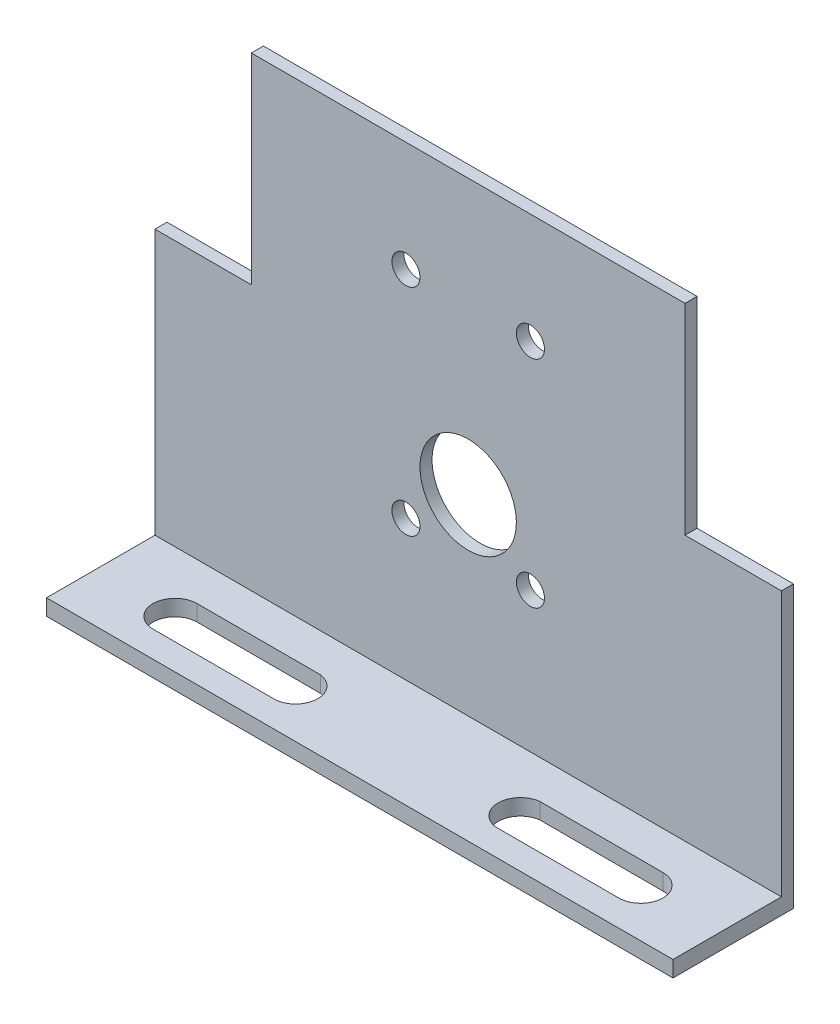
ISO-10303-21;
HEADER;
FILE_DESCRIPTION(('STEP AP214'),'2;1');
FILE_NAME('part.step','',(''),(''),'','','');
FILE_SCHEMA(('AUTOMOTIVE_DESIGN { 1 0 10303 214 1 1 1 1 }'));
ENDSEC;
DATA;
#1=APPLICATION_CONTEXT('core data for automotive mechanical design processes');
#2=APPLICATION_PROTOCOL_DEFINITION('international standard','automotive_design',2000,#1);
#3=PRODUCT_CONTEXT('',#1,'mechanical');
#4=PRODUCT('Part','Part','',(#3));
#5=PRODUCT_RELATED_PRODUCT_CATEGORY('part','',(#4));
#6=PRODUCT_DEFINITION_FORMATION('','',#4);
#7=PRODUCT_DEFINITION_CONTEXT('part definition',#1,'design');
#8=PRODUCT_DEFINITION('design','',#6,#7);
#9=PRODUCT_DEFINITION_SHAPE('','',#8);
#10=(LENGTH_UNIT() NAMED_UNIT(*) SI_UNIT(.MILLI.,.METRE.));
#11=(NAMED_UNIT(*) PLANE_ANGLE_UNIT() SI_UNIT($,.RADIAN.));
#12=(NAMED_UNIT(*) SI_UNIT($,.STERADIAN.) SOLID_ANGLE_UNIT());
#13=UNCERTAINTY_MEASURE_WITH_UNIT(LENGTH_MEASURE(1.E-05),#10,'distance_accuracy_value','');
#14=(GEOMETRIC_REPRESENTATION_CONTEXT(3) GLOBAL_UNCERTAINTY_ASSIGNED_CONTEXT((#13)) GLOBAL_UNIT_ASSIGNED_CONTEXT((#10,
#11,#12)) REPRESENTATION_CONTEXT('',''));
#15=CARTESIAN_POINT('',(0.,0.,0.));
#16=DIRECTION('',(0.,0.,1.));
#17=DIRECTION('',(1.,0.,0.));
#18=AXIS2_PLACEMENT_3D('',#15,#16,#17);
#19=CARTESIAN_POINT('',(0.,0.,1.5));
#20=DIRECTION('',(0.,0.,-1.));
#21=DIRECTION('',(-1.,0.,0.));
#22=AXIS2_PLACEMENT_3D('',#19,#20,#21);
#23=PLANE('',#22);
#24=DIRECTION('',(0.,-1.,0.));
#25=VECTOR('',#24,1.);
#26=CARTESIAN_POINT('',(-77.9999999999994,0.,1.5));
#27=LINE('',#26,#25);
#28=CARTESIAN_POINT('',(-77.9999999999994,34.9999999999999,1.5));
#29=VERTEX_POINT('',#28);
#30=CARTESIAN_POINT('',(-77.9999999999994,2.,1.5));
#31=VERTEX_POINT('',#30);
#32=EDGE_CURVE('E257',#29,#31,#27,.T.);
#33=ORIENTED_EDGE('',*,*,#32,.T.);
#34=DIRECTION('',(1.,0.,0.));
#35=VECTOR('',#34,1.);
#36=CARTESIAN_POINT('',(0.,1.99999999999999,1.5));
#37=LINE('',#36,#35);
#38=CARTESIAN_POINT('',(0.,1.99999999999999,1.5));
#39=VERTEX_POINT('',#38);
#40=EDGE_CURVE('E221',#31,#39,#37,.T.);
#41=ORIENTED_EDGE('',*,*,#40,.T.);
#42=DIRECTION('',(0.,1.,0.));
#43=VECTOR('',#42,1.);
#44=CARTESIAN_POINT('',(0.,0.,1.5));
#45=LINE('',#44,#43);
#46=CARTESIAN_POINT('',(0.,34.9999999999999,1.5));
#47=VERTEX_POINT('',#46);
#48=EDGE_CURVE('E260',#39,#47,#45,.T.);
#49=ORIENTED_EDGE('',*,*,#48,.T.);
#50=DIRECTION('',(-1.,0.,0.));
#51=VECTOR('',#50,1.);
#52=CARTESIAN_POINT('',(-11.9999999999987,34.9999999999999,1.5));
#53=LINE('',#52,#51);
#54=CARTESIAN_POINT('',(-11.9999999999987,34.9999999999999,1.5));
#55=VERTEX_POINT('',#54);
#56=EDGE_CURVE('E263',#47,#55,#53,.T.);
#57=ORIENTED_EDGE('',*,*,#56,.T.);
#58=DIRECTION('',(0.,1.,0.));
#59=VECTOR('',#58,1.);
#60=CARTESIAN_POINT('',(-11.9999999999987,59.9999999999998,1.5));
#61=LINE('',#60,#59);
#62=CARTESIAN_POINT('',(-11.9999999999987,59.9999999999998,1.5));
#63=VERTEX_POINT('',#62);
#64=EDGE_CURVE('E265',#55,#63,#61,.T.);
#65=ORIENTED_EDGE('',*,*,#64,.T.);
#66=DIRECTION('',(-1.,0.,0.));
#67=VECTOR('',#66,1.);
#68=CARTESIAN_POINT('',(-65.9999999999989,59.9999999999998,1.5));
#69=LINE('',#68,#67);
#70=CARTESIAN_POINT('',(-65.9999999999989,59.9999999999998,1.5));
#71=VERTEX_POINT('',#70);
#72=EDGE_CURVE('E267',#63,#71,#69,.T.);
#73=ORIENTED_EDGE('',*,*,#72,.T.);
#74=DIRECTION('',(0.,-1.,0.));
#75=VECTOR('',#74,1.);
#76=CARTESIAN_POINT('',(-65.9999999999989,34.9999999999999,1.5));
#77=LINE('',#76,#75);
#78=CARTESIAN_POINT('',(-65.9999999999989,34.9999999999999,1.5));
#79=VERTEX_POINT('',#78);
#80=EDGE_CURVE('E269',#71,#79,#77,.T.);
#81=ORIENTED_EDGE('',*,*,#80,.T.);
#82=DIRECTION('',(-1.,0.,0.));
#83=VECTOR('',#82,1.);
#84=CARTESIAN_POINT('',(-77.9999999999994,34.9999999999999,1.5));
#85=LINE('',#84,#83);
#86=EDGE_CURVE('E271',#79,#29,#85,.T.);
#87=ORIENTED_EDGE('',*,*,#86,.T.);
#88=EDGE_LOOP('',(#33,#41,#49,#57,#65,#73,#81,#87));
#89=FACE_BOUND('',#88,.T.);
#90=CARTESIAN_POINT('',(-38.9999999999997,25.8700000000001,1.5));
#91=DIRECTION('',(0.,0.,1.));
#92=DIRECTION('',(1.,0.,0.));
#93=AXIS2_PLACEMENT_3D('',#90,#91,#92);
#94=CIRCLE('',#93,6.00000000000023);
#95=CARTESIAN_POINT('',(-32.9999999999995,25.8700000000001,1.5));
#96=VERTEX_POINT('',#95);
#97=EDGE_CURVE('E251',#96,#96,#94,.T.);
#98=ORIENTED_EDGE('',*,*,#97,.F.);
#99=EDGE_LOOP('',(#98));
#100=FACE_BOUND('',#99,.T.);
#101=CARTESIAN_POINT('',(-31.25,19.4458821554209,1.5));
#102=DIRECTION('',(0.,0.,1.));
#103=DIRECTION('',(1.,0.,0.));
#104=AXIS2_PLACEMENT_3D('',#101,#102,#103);
#105=CIRCLE('',#104,1.74999999999947);
#106=CARTESIAN_POINT('',(-29.5000000000005,19.4458821554209,1.5));
#107=VERTEX_POINT('',#106);
#108=EDGE_CURVE('E245',#107,#107,#105,.T.);
#109=ORIENTED_EDGE('',*,*,#108,.F.);
#110=EDGE_LOOP('',(#109));
#111=FACE_BOUND('',#110,.T.);
#112=CARTESIAN_POINT('',(-46.7499999999994,19.4458821554209,1.5));
#113=DIRECTION('',(0.,0.,1.));
#114=DIRECTION('',(1.,0.,0.));
#115=AXIS2_PLACEMENT_3D('',#112,#113,#114);
#116=CIRCLE('',#115,1.74999999999947);
#117=CARTESIAN_POINT('',(-44.9999999999999,19.4458821554209,1.5));
#118=VERTEX_POINT('',#117);
#119=EDGE_CURVE('E239',#118,#118,#116,.T.);
#120=ORIENTED_EDGE('',*,*,#119,.F.);
#121=EDGE_LOOP('',(#120));
#122=FACE_BOUND('',#121,.T.);
#123=CARTESIAN_POINT('',(-46.7499999999994,46.2926696734212,1.5));
#124=DIRECTION('',(0.,0.,1.));
#125=DIRECTION('',(1.,0.,0.));
#126=AXIS2_PLACEMENT_3D('',#123,#124,#125);
#127=CIRCLE('',#126,1.74999999999947);
#128=CARTESIAN_POINT('',(-44.9999999999999,46.2926696734212,1.5));
#129=VERTEX_POINT('',#128);
#130=EDGE_CURVE('E233',#129,#129,#127,.T.);
#131=ORIENTED_EDGE('',*,*,#130,.F.);
#132=EDGE_LOOP('',(#131));
#133=FACE_BOUND('',#132,.T.);
#134=CARTESIAN_POINT('',(-31.25,46.2926696734212,1.5));
#135=DIRECTION('',(0.,0.,1.));
#136=DIRECTION('',(1.,0.,0.));
#137=AXIS2_PLACEMENT_3D('',#134,#135,#136);
#138=CIRCLE('',#137,1.74999999999947);
#139=CARTESIAN_POINT('',(-29.5000000000005,46.2926696734212,1.5));
#140=VERTEX_POINT('',#139);
#141=EDGE_CURVE('E227',#140,#140,#138,.T.);
#142=ORIENTED_EDGE('',*,*,#141,.F.);
#143=EDGE_LOOP('',(#142));
#144=FACE_BOUND('',#143,.T.);
#145=ADVANCED_FACE('F35',(#89,#100,#111,#122,#133,#144),#23,.F.);
#146=CARTESIAN_POINT('',(0.,0.,0.));
#147=DIRECTION('',(0.,0.,-1.));
#148=DIRECTION('',(-1.,0.,0.));
#149=AXIS2_PLACEMENT_3D('',#146,#147,#148);
#150=PLANE('',#149);
#151=DIRECTION('',(-1.,0.,0.));
#152=VECTOR('',#151,1.);
#153=CARTESIAN_POINT('',(-11.9999999999987,34.9999999999999,0.));
#154=LINE('',#153,#152);
#155=CARTESIAN_POINT('',(0.,34.9999999999999,0.));
#156=VERTEX_POINT('',#155);
#157=CARTESIAN_POINT('',(-11.9999999999987,34.9999999999999,0.));
#158=VERTEX_POINT('',#157);
#159=EDGE_CURVE('E279',#156,#158,#154,.T.);
#160=ORIENTED_EDGE('',*,*,#159,.F.);
#161=DIRECTION('',(0.,1.,0.));
#162=VECTOR('',#161,1.);
#163=CARTESIAN_POINT('',(0.,2.73659999999998,0.));
#164=LINE('',#163,#162);
#165=CARTESIAN_POINT('',(0.,0.,0.));
#166=VERTEX_POINT('',#165);
#167=EDGE_CURVE('E277',#166,#156,#164,.T.);
#168=ORIENTED_EDGE('',*,*,#167,.F.);
#169=DIRECTION('',(1.,0.,0.));
#170=VECTOR('',#169,1.);
#171=CARTESIAN_POINT('',(-77.9999999999994,0.,0.));
#172=LINE('',#171,#170);
#173=CARTESIAN_POINT('',(-77.9999999999994,0.,0.));
#174=VERTEX_POINT('',#173);
#175=EDGE_CURVE('E254',#174,#166,#172,.T.);
#176=ORIENTED_EDGE('',*,*,#175,.F.);
#177=DIRECTION('',(0.,-1.,0.));
#178=VECTOR('',#177,1.);
#179=CARTESIAN_POINT('',(-77.9999999999994,2.73659999999998,0.));
#180=LINE('',#179,#178);
#181=CARTESIAN_POINT('',(-77.9999999999994,34.9999999999999,0.));
#182=VERTEX_POINT('',#181);
#183=EDGE_CURVE('E261',#182,#174,#180,.T.);
#184=ORIENTED_EDGE('',*,*,#183,.F.);
#185=DIRECTION('',(-1.,0.,0.));
#186=VECTOR('',#185,1.);
#187=CARTESIAN_POINT('',(-77.9999999999994,34.9999999999999,0.));
#188=LINE('',#187,#186);
#189=CARTESIAN_POINT('',(-65.9999999999989,34.9999999999999,0.));
#190=VERTEX_POINT('',#189);
#191=EDGE_CURVE('E287',#190,#182,#188,.T.);
#192=ORIENTED_EDGE('',*,*,#191,.F.);
#193=DIRECTION('',(0.,-1.,0.));
#194=VECTOR('',#193,1.);
#195=CARTESIAN_POINT('',(-65.9999999999989,34.9999999999999,0.));
#196=LINE('',#195,#194);
#197=CARTESIAN_POINT('',(-65.9999999999989,59.9999999999998,0.));
#198=VERTEX_POINT('',#197);
#199=EDGE_CURVE('E285',#198,#190,#196,.T.);
#200=ORIENTED_EDGE('',*,*,#199,.F.);
#201=DIRECTION('',(-1.,0.,0.));
#202=VECTOR('',#201,1.);
#203=CARTESIAN_POINT('',(-65.9999999999989,59.9999999999998,0.));
#204=LINE('',#203,#202);
#205=CARTESIAN_POINT('',(-11.9999999999987,59.9999999999998,0.));
#206=VERTEX_POINT('',#205);
#207=EDGE_CURVE('E283',#206,#198,#204,.T.);
#208=ORIENTED_EDGE('',*,*,#207,.F.);
#209=DIRECTION('',(0.,1.,0.));
#210=VECTOR('',#209,1.);
#211=CARTESIAN_POINT('',(-11.9999999999987,59.9999999999998,0.));
#212=LINE('',#211,#210);
#213=EDGE_CURVE('E281',#158,#206,#212,.T.);
#214=ORIENTED_EDGE('',*,*,#213,.F.);
#215=EDGE_LOOP('',(#160,#168,#176,#184,#192,#200,#208,#214));
#216=FACE_BOUND('',#215,.T.);
#217=CARTESIAN_POINT('',(-46.7499999999994,46.2926696734212,0.));
#218=DIRECTION('',(0.,0.,1.));
#219=DIRECTION('',(1.,0.,0.));
#220=AXIS2_PLACEMENT_3D('',#217,#218,#219);
#221=CIRCLE('',#220,1.74999999999947);
#222=CARTESIAN_POINT('',(-44.9999999999999,46.2926696734212,0.));
#223=VERTEX_POINT('',#222);
#224=EDGE_CURVE('E230',#223,#223,#221,.T.);
#225=ORIENTED_EDGE('',*,*,#224,.T.);
#226=EDGE_LOOP('',(#225));
#227=FACE_BOUND('',#226,.T.);
#228=CARTESIAN_POINT('',(-31.25,19.4458821554209,0.));
#229=DIRECTION('',(0.,0.,1.));
#230=DIRECTION('',(1.,0.,0.));
#231=AXIS2_PLACEMENT_3D('',#228,#229,#230);
#232=CIRCLE('',#231,1.74999999999947);
#233=CARTESIAN_POINT('',(-29.5000000000005,19.4458821554209,0.));
#234=VERTEX_POINT('',#233);
#235=EDGE_CURVE('E242',#234,#234,#232,.T.);
#236=ORIENTED_EDGE('',*,*,#235,.T.);
#237=EDGE_LOOP('',(#236));
#238=FACE_BOUND('',#237,.T.);
#239=CARTESIAN_POINT('',(-38.9999999999997,25.8700000000001,0.));
#240=DIRECTION('',(0.,0.,1.));
#241=DIRECTION('',(1.,0.,0.));
#242=AXIS2_PLACEMENT_3D('',#239,#240,#241);
#243=CIRCLE('',#242,6.00000000000023);
#244=CARTESIAN_POINT('',(-32.9999999999995,25.8700000000001,0.));
#245=VERTEX_POINT('',#244);
#246=EDGE_CURVE('E248',#245,#245,#243,.T.);
#247=ORIENTED_EDGE('',*,*,#246,.T.);
#248=EDGE_LOOP('',(#247));
#249=FACE_BOUND('',#248,.T.);
#250=CARTESIAN_POINT('',(-46.7499999999994,19.4458821554209,0.));
#251=DIRECTION('',(0.,0.,1.));
#252=DIRECTION('',(1.,0.,0.));
#253=AXIS2_PLACEMENT_3D('',#250,#251,#252);
#254=CIRCLE('',#253,1.74999999999947);
#255=CARTESIAN_POINT('',(-44.9999999999999,19.4458821554209,0.));
#256=VERTEX_POINT('',#255);
#257=EDGE_CURVE('E236',#256,#256,#254,.T.);
#258=ORIENTED_EDGE('',*,*,#257,.T.);
#259=EDGE_LOOP('',(#258));
#260=FACE_BOUND('',#259,.T.);
#261=CARTESIAN_POINT('',(-31.25,46.2926696734212,0.));
#262=DIRECTION('',(0.,0.,1.));
#263=DIRECTION('',(1.,0.,0.));
#264=AXIS2_PLACEMENT_3D('',#261,#262,#263);
#265=CIRCLE('',#264,1.74999999999947);
#266=CARTESIAN_POINT('',(-29.5000000000005,46.2926696734212,0.));
#267=VERTEX_POINT('',#266);
#268=EDGE_CURVE('E226',#267,#267,#265,.T.);
#269=ORIENTED_EDGE('',*,*,#268,.T.);
#270=EDGE_LOOP('',(#269));
#271=FACE_BOUND('',#270,.T.);
#272=ADVANCED_FACE('F348',(#216,#227,#238,#249,#260,#271),#150,.T.);
#273=CARTESIAN_POINT('',(-77.9999999999994,0.,1.5));
#274=DIRECTION('',(0.,1.,0.));
#275=DIRECTION('',(0.,0.,1.));
#276=AXIS2_PLACEMENT_3D('',#273,#274,#275);
#277=PLANE('',#276);
#278=DIRECTION('',(1.,0.,0.));
#279=VECTOR('',#278,1.);
#280=CARTESIAN_POINT('',(-9.9999999999997,0.,6.25000000000001));
#281=LINE('',#280,#279);
#282=CARTESIAN_POINT('',(-25.3311666945418,0.,6.25000000000001));
#283=VERTEX_POINT('',#282);
#284=CARTESIAN_POINT('',(-9.9999999999997,0.,6.25000000000001));
#285=VERTEX_POINT('',#284);
#286=EDGE_CURVE('E171',#283,#285,#281,.T.);
#287=ORIENTED_EDGE('',*,*,#286,.F.);
#288=CARTESIAN_POINT('',(-24.9999999999997,0.,9.00000000000001));
#289=DIRECTION('',(0.,-1.,0.));
#290=DIRECTION('',(0.,0.,1.));
#291=AXIS2_PLACEMENT_3D('',#288,#289,#290);
#292=CIRCLE('',#291,2.76986847694505);
#293=CARTESIAN_POINT('',(-25.3311666945417,0.,11.75));
#294=VERTEX_POINT('',#293);
#295=EDGE_CURVE('E50',#294,#283,#292,.T.);
#296=ORIENTED_EDGE('',*,*,#295,.F.);
#297=DIRECTION('',(-1.,0.,0.));
#298=VECTOR('',#297,1.);
#299=CARTESIAN_POINT('',(-9.9999999999997,0.,11.75));
#300=LINE('',#299,#298);
#301=CARTESIAN_POINT('',(-9.9999999999997,0.,11.75));
#302=VERTEX_POINT('',#301);
#303=EDGE_CURVE('E177',#302,#294,#300,.T.);
#304=ORIENTED_EDGE('',*,*,#303,.F.);
#305=CARTESIAN_POINT('',(-9.9999999999997,0.,9.00000000000001));
#306=DIRECTION('',(0.,-1.,0.));
#307=DIRECTION('',(0.,0.,1.));
#308=AXIS2_PLACEMENT_3D('',#305,#306,#307);
#309=CIRCLE('',#308,2.75);
#310=EDGE_CURVE('E162',#285,#302,#309,.T.);
#311=ORIENTED_EDGE('',*,*,#310,.F.);
#312=EDGE_LOOP('',(#287,#296,#304,#311));
#313=FACE_BOUND('',#312,.T.);
#314=DIRECTION('',(1.,0.,0.));
#315=VECTOR('',#314,1.);
#316=CARTESIAN_POINT('',(-67.9999999999997,0.,6.25));
#317=LINE('',#316,#315);
#318=CARTESIAN_POINT('',(-67.9999999999997,0.,6.25));
#319=VERTEX_POINT('',#318);
#320=CARTESIAN_POINT('',(-52.6688333054576,0.,6.25));
#321=VERTEX_POINT('',#320);
#322=EDGE_CURVE('E188',#319,#321,#317,.T.);
#323=ORIENTED_EDGE('',*,*,#322,.F.);
#324=CARTESIAN_POINT('',(-67.9999999999997,0.,9.));
#325=DIRECTION('',(0.,-1.,0.));
#326=DIRECTION('',(0.,0.,-1.));
#327=AXIS2_PLACEMENT_3D('',#324,#325,#326);
#328=CIRCLE('',#327,2.75);
#329=CARTESIAN_POINT('',(-67.9999999999997,0.,11.75));
#330=VERTEX_POINT('',#329);
#331=EDGE_CURVE('E184',#330,#319,#328,.T.);
#332=ORIENTED_EDGE('',*,*,#331,.F.);
#333=DIRECTION('',(-1.,0.,0.));
#334=VECTOR('',#333,1.);
#335=CARTESIAN_POINT('',(-67.9999999999997,0.,11.75));
#336=LINE('',#335,#334);
#337=CARTESIAN_POINT('',(-52.6688333054577,0.,11.75));
#338=VERTEX_POINT('',#337);
#339=EDGE_CURVE('E194',#338,#330,#336,.T.);
#340=ORIENTED_EDGE('',*,*,#339,.F.);
#341=CARTESIAN_POINT('',(-52.9999999999997,0.,9.));
#342=DIRECTION('',(0.,-1.,0.));
#343=DIRECTION('',(0.,0.,-1.));
#344=AXIS2_PLACEMENT_3D('',#341,#342,#343);
#345=CIRCLE('',#344,2.76986847694505);
#346=EDGE_CURVE('E191',#321,#338,#345,.T.);
#347=ORIENTED_EDGE('',*,*,#346,.F.);
#348=EDGE_LOOP('',(#323,#332,#340,#347));
#349=FACE_BOUND('',#348,.T.);
#350=ORIENTED_EDGE('',*,*,#175,.T.);
#351=DIRECTION('',(0.,0.,-1.));
#352=VECTOR('',#351,1.);
#353=CARTESIAN_POINT('',(0.,0.,1.5));
#354=LINE('',#353,#352);
#355=CARTESIAN_POINT('',(0.,0.,15.));
#356=VERTEX_POINT('',#355);
#357=EDGE_CURVE('E308',#356,#166,#354,.T.);
#358=ORIENTED_EDGE('',*,*,#357,.F.);
#359=DIRECTION('',(-1.,0.,0.));
#360=VECTOR('',#359,1.);
#361=CARTESIAN_POINT('',(-77.9999999999994,0.,15.));
#362=LINE('',#361,#360);
#363=CARTESIAN_POINT('',(-77.9999999999994,0.,15.));
#364=VERTEX_POINT('',#363);
#365=EDGE_CURVE('E215',#356,#364,#362,.T.);
#366=ORIENTED_EDGE('',*,*,#365,.T.);
#367=DIRECTION('',(0.,0.,-1.));
#368=VECTOR('',#367,1.);
#369=CARTESIAN_POINT('',(-77.9999999999994,0.,1.5));
#370=LINE('',#369,#368);
#371=EDGE_CURVE('E311',#364,#174,#370,.T.);
#372=ORIENTED_EDGE('',*,*,#371,.T.);
#373=EDGE_LOOP('',(#350,#358,#366,#372));
#374=FACE_BOUND('',#373,.T.);
#375=ADVANCED_FACE('F37',(#313,#349,#374),#277,.F.);
#376=CARTESIAN_POINT('',(0.,2.73659999999998,1.5));
#377=DIRECTION('',(-1.,0.,0.));
#378=DIRECTION('',(0.,0.,1.));
#379=AXIS2_PLACEMENT_3D('',#376,#377,#378);
#380=PLANE('',#379);
#381=ORIENTED_EDGE('',*,*,#48,.F.);
#382=DIRECTION('',(0.,0.,-1.));
#383=VECTOR('',#382,1.);
#384=CARTESIAN_POINT('',(0.,1.99999999999999,15.));
#385=LINE('',#384,#383);
#386=CARTESIAN_POINT('',(0.,1.99999999999999,15.));
#387=VERTEX_POINT('',#386);
#388=EDGE_CURVE('E219',#387,#39,#385,.T.);
#389=ORIENTED_EDGE('',*,*,#388,.F.);
#390=DIRECTION('',(0.,-1.,0.));
#391=VECTOR('',#390,1.);
#392=CARTESIAN_POINT('',(0.,0.,15.));
#393=LINE('',#392,#391);
#394=EDGE_CURVE('E212',#387,#356,#393,.T.);
#395=ORIENTED_EDGE('',*,*,#394,.T.);
#396=ORIENTED_EDGE('',*,*,#357,.T.);
#397=ORIENTED_EDGE('',*,*,#167,.T.);
#398=DIRECTION('',(0.,0.,-1.));
#399=VECTOR('',#398,1.);
#400=CARTESIAN_POINT('',(0.,34.9999999999999,1.5));
#401=LINE('',#400,#399);
#402=EDGE_CURVE('E305',#47,#156,#401,.T.);
#403=ORIENTED_EDGE('',*,*,#402,.F.);
#404=EDGE_LOOP('',(#381,#389,#395,#396,#397,#403));
#405=FACE_BOUND('',#404,.T.);
#406=ADVANCED_FACE('F384',(#405),#380,.F.);
#407=CARTESIAN_POINT('',(-11.9999999999987,34.9999999999999,1.5));
#408=DIRECTION('',(0.,-1.,0.));
#409=DIRECTION('',(0.,0.,-1.));
#410=AXIS2_PLACEMENT_3D('',#407,#408,#409);
#411=PLANE('',#410);
#412=ORIENTED_EDGE('',*,*,#159,.T.);
#413=DIRECTION('',(0.,0.,-1.));
#414=VECTOR('',#413,1.);
#415=CARTESIAN_POINT('',(-11.9999999999987,34.9999999999999,1.5));
#416=LINE('',#415,#414);
#417=EDGE_CURVE('E302',#55,#158,#416,.T.);
#418=ORIENTED_EDGE('',*,*,#417,.F.);
#419=ORIENTED_EDGE('',*,*,#56,.F.);
#420=ORIENTED_EDGE('',*,*,#402,.T.);
#421=EDGE_LOOP('',(#412,#418,#419,#420));
#422=FACE_BOUND('',#421,.T.);
#423=ADVANCED_FACE('F381',(#422),#411,.F.);
#424=CARTESIAN_POINT('',(-11.9999999999987,59.9999999999998,1.5));
#425=DIRECTION('',(-1.,0.,0.));
#426=DIRECTION('',(0.,0.,1.));
#427=AXIS2_PLACEMENT_3D('',#424,#425,#426);
#428=PLANE('',#427);
#429=ORIENTED_EDGE('',*,*,#213,.T.);
#430=DIRECTION('',(0.,0.,-1.));
#431=VECTOR('',#430,1.);
#432=CARTESIAN_POINT('',(-11.9999999999987,59.9999999999998,1.5));
#433=LINE('',#432,#431);
#434=EDGE_CURVE('E299',#63,#206,#433,.T.);
#435=ORIENTED_EDGE('',*,*,#434,.F.);
#436=ORIENTED_EDGE('',*,*,#64,.F.);
#437=ORIENTED_EDGE('',*,*,#417,.T.);
#438=EDGE_LOOP('',(#429,#435,#436,#437));
#439=FACE_BOUND('',#438,.T.);
#440=ADVANCED_FACE('F377',(#439),#428,.F.);
#441=CARTESIAN_POINT('',(-65.9999999999989,59.9999999999998,1.5));
#442=DIRECTION('',(0.,-1.,0.));
#443=DIRECTION('',(0.,0.,-1.));
#444=AXIS2_PLACEMENT_3D('',#441,#442,#443);
#445=PLANE('',#444);
#446=ORIENTED_EDGE('',*,*,#207,.T.);
#447=DIRECTION('',(0.,0.,-1.));
#448=VECTOR('',#447,1.);
#449=CARTESIAN_POINT('',(-65.9999999999989,59.9999999999998,1.5));
#450=LINE('',#449,#448);
#451=EDGE_CURVE('E296',#71,#198,#450,.T.);
#452=ORIENTED_EDGE('',*,*,#451,.F.);
#453=ORIENTED_EDGE('',*,*,#72,.F.);
#454=ORIENTED_EDGE('',*,*,#434,.T.);
#455=EDGE_LOOP('',(#446,#452,#453,#454));
#456=FACE_BOUND('',#455,.T.);
#457=ADVANCED_FACE('F373',(#456),#445,.F.);
#458=CARTESIAN_POINT('',(-65.9999999999989,34.9999999999999,1.5));
#459=DIRECTION('',(1.,0.,0.));
#460=DIRECTION('',(0.,0.,-1.));
#461=AXIS2_PLACEMENT_3D('',#458,#459,#460);
#462=PLANE('',#461);
#463=ORIENTED_EDGE('',*,*,#199,.T.);
#464=DIRECTION('',(0.,0.,-1.));
#465=VECTOR('',#464,1.);
#466=CARTESIAN_POINT('',(-65.9999999999989,34.9999999999999,1.5));
#467=LINE('',#466,#465);
#468=EDGE_CURVE('E293',#79,#190,#467,.T.);
#469=ORIENTED_EDGE('',*,*,#468,.F.);
#470=ORIENTED_EDGE('',*,*,#80,.F.);
#471=ORIENTED_EDGE('',*,*,#451,.T.);
#472=EDGE_LOOP('',(#463,#469,#470,#471));
#473=FACE_BOUND('',#472,.T.);
#474=ADVANCED_FACE('F369',(#473),#462,.F.);
#475=CARTESIAN_POINT('',(-77.9999999999994,34.9999999999999,1.5));
#476=DIRECTION('',(0.,-1.,0.));
#477=DIRECTION('',(0.,0.,-1.));
#478=AXIS2_PLACEMENT_3D('',#475,#476,#477);
#479=PLANE('',#478);
#480=ORIENTED_EDGE('',*,*,#191,.T.);
#481=DIRECTION('',(0.,0.,-1.));
#482=VECTOR('',#481,1.);
#483=CARTESIAN_POINT('',(-77.9999999999994,34.9999999999999,1.5));
#484=LINE('',#483,#482);
#485=EDGE_CURVE('E274',#29,#182,#484,.T.);
#486=ORIENTED_EDGE('',*,*,#485,.F.);
#487=ORIENTED_EDGE('',*,*,#86,.F.);
#488=ORIENTED_EDGE('',*,*,#468,.T.);
#489=EDGE_LOOP('',(#480,#486,#487,#488));
#490=FACE_BOUND('',#489,.T.);
#491=ADVANCED_FACE('F365',(#490),#479,.F.);
#492=CARTESIAN_POINT('',(-77.9999999999994,2.73659999999998,1.5));
#493=DIRECTION('',(1.,0.,0.));
#494=DIRECTION('',(0.,0.,-1.));
#495=AXIS2_PLACEMENT_3D('',#492,#493,#494);
#496=PLANE('',#495);
#497=ORIENTED_EDGE('',*,*,#183,.T.);
#498=ORIENTED_EDGE('',*,*,#371,.F.);
#499=DIRECTION('',(0.,1.,0.));
#500=VECTOR('',#499,1.);
#501=CARTESIAN_POINT('',(-77.9999999999994,0.,15.));
#502=LINE('',#501,#500);
#503=CARTESIAN_POINT('',(-77.9999999999994,2.,15.));
#504=VERTEX_POINT('',#503);
#505=EDGE_CURVE('E200',#364,#504,#502,.T.);
#506=ORIENTED_EDGE('',*,*,#505,.T.);
#507=DIRECTION('',(0.,0.,-1.));
#508=VECTOR('',#507,1.);
#509=CARTESIAN_POINT('',(-77.9999999999994,2.,15.));
#510=LINE('',#509,#508);
#511=EDGE_CURVE('E218',#504,#31,#510,.T.);
#512=ORIENTED_EDGE('',*,*,#511,.T.);
#513=ORIENTED_EDGE('',*,*,#32,.F.);
#514=ORIENTED_EDGE('',*,*,#485,.T.);
#515=EDGE_LOOP('',(#497,#498,#506,#512,#513,#514));
#516=FACE_BOUND('',#515,.T.);
#517=ADVANCED_FACE('F362',(#516),#496,.F.);
#518=CARTESIAN_POINT('',(-38.9999999999997,25.8700000000001,1.5));
#519=DIRECTION('',(0.,0.,-1.));
#520=DIRECTION('',(-1.,0.,0.));
#521=AXIS2_PLACEMENT_3D('',#518,#519,#520);
#522=CYLINDRICAL_SURFACE('',#521,6.00000000000023);
#523=ORIENTED_EDGE('',*,*,#97,.T.);
#524=EDGE_LOOP('',(#523));
#525=FACE_BOUND('',#524,.T.);
#526=ORIENTED_EDGE('',*,*,#246,.F.);
#527=EDGE_LOOP('',(#526));
#528=FACE_BOUND('',#527,.T.);
#529=ADVANCED_FACE('F359',(#525,#528),#522,.F.);
#530=CARTESIAN_POINT('',(-31.25,19.4458821554209,1.5));
#531=DIRECTION('',(0.,0.,-1.));
#532=DIRECTION('',(-1.,0.,0.));
#533=AXIS2_PLACEMENT_3D('',#530,#531,#532);
#534=CYLINDRICAL_SURFACE('',#533,1.74999999999947);
#535=ORIENTED_EDGE('',*,*,#108,.T.);
#536=EDGE_LOOP('',(#535));
#537=FACE_BOUND('',#536,.T.);
#538=ORIENTED_EDGE('',*,*,#235,.F.);
#539=EDGE_LOOP('',(#538));
#540=FACE_BOUND('',#539,.T.);
#541=ADVANCED_FACE('F444',(#537,#540),#534,.F.);
#542=CARTESIAN_POINT('',(-46.7499999999994,19.4458821554209,1.5));
#543=DIRECTION('',(0.,0.,-1.));
#544=DIRECTION('',(-1.,0.,0.));
#545=AXIS2_PLACEMENT_3D('',#542,#543,#544);
#546=CYLINDRICAL_SURFACE('',#545,1.74999999999947);
#547=ORIENTED_EDGE('',*,*,#119,.T.);
#548=EDGE_LOOP('',(#547));
#549=FACE_BOUND('',#548,.T.);
#550=ORIENTED_EDGE('',*,*,#257,.F.);
#551=EDGE_LOOP('',(#550));
#552=FACE_BOUND('',#551,.T.);
#553=ADVANCED_FACE('F438',(#549,#552),#546,.F.);
#554=CARTESIAN_POINT('',(-46.7499999999994,46.2926696734212,1.5));
#555=DIRECTION('',(0.,0.,-1.));
#556=DIRECTION('',(-1.,0.,0.));
#557=AXIS2_PLACEMENT_3D('',#554,#555,#556);
#558=CYLINDRICAL_SURFACE('',#557,1.74999999999947);
#559=ORIENTED_EDGE('',*,*,#130,.T.);
#560=EDGE_LOOP('',(#559));
#561=FACE_BOUND('',#560,.T.);
#562=ORIENTED_EDGE('',*,*,#224,.F.);
#563=EDGE_LOOP('',(#562));
#564=FACE_BOUND('',#563,.T.);
#565=ADVANCED_FACE('F431',(#561,#564),#558,.F.);
#566=CARTESIAN_POINT('',(-31.25,46.2926696734212,1.5));
#567=DIRECTION('',(0.,0.,-1.));
#568=DIRECTION('',(-1.,0.,0.));
#569=AXIS2_PLACEMENT_3D('',#566,#567,#568);
#570=CYLINDRICAL_SURFACE('',#569,1.74999999999947);
#571=ORIENTED_EDGE('',*,*,#141,.T.);
#572=EDGE_LOOP('',(#571));
#573=FACE_BOUND('',#572,.T.);
#574=ORIENTED_EDGE('',*,*,#268,.F.);
#575=EDGE_LOOP('',(#574));
#576=FACE_BOUND('',#575,.T.);
#577=ADVANCED_FACE('F429',(#573,#576),#570,.F.);
#578=CARTESIAN_POINT('',(-77.9999999999994,2.,15.));
#579=DIRECTION('',(0.,1.,0.));
#580=DIRECTION('',(-1.,0.,0.));
#581=AXIS2_PLACEMENT_3D('',#578,#579,#580);
#582=PLANE('',#581);
#583=CARTESIAN_POINT('',(-24.9999999999997,1.99999999999999,9.00000000000001));
#584=DIRECTION('',(0.,1.,0.));
#585=DIRECTION('',(-1.,0.,0.));
#586=AXIS2_PLACEMENT_3D('',#583,#584,#585);
#587=CIRCLE('',#586,2.76986847694505);
#588=CARTESIAN_POINT('',(-25.3311666945418,1.99999999999999,6.25000000000001));
#589=VERTEX_POINT('',#588);
#590=CARTESIAN_POINT('',(-25.3311666945417,1.99999999999999,11.75));
#591=VERTEX_POINT('',#590);
#592=EDGE_CURVE('E11',#589,#591,#587,.T.);
#593=ORIENTED_EDGE('',*,*,#592,.F.);
#594=DIRECTION('',(-1.,0.,0.));
#595=VECTOR('',#594,1.);
#596=CARTESIAN_POINT('',(-77.9999999999994,2.,6.24999999999999));
#597=LINE('',#596,#595);
#598=CARTESIAN_POINT('',(-9.9999999999997,1.99999999999999,6.25000000000001));
#599=VERTEX_POINT('',#598);
#600=EDGE_CURVE('E323',#599,#589,#597,.T.);
#601=ORIENTED_EDGE('',*,*,#600,.F.);
#602=CARTESIAN_POINT('',(-9.9999999999997,1.99999999999999,9.00000000000001));
#603=DIRECTION('',(0.,1.,0.));
#604=DIRECTION('',(-1.,0.,0.));
#605=AXIS2_PLACEMENT_3D('',#602,#603,#604);
#606=CIRCLE('',#605,2.75);
#607=CARTESIAN_POINT('',(-9.9999999999997,1.99999999999999,11.75));
#608=VERTEX_POINT('',#607);
#609=EDGE_CURVE('E165',#608,#599,#606,.T.);
#610=ORIENTED_EDGE('',*,*,#609,.F.);
#611=DIRECTION('',(1.,0.,0.));
#612=VECTOR('',#611,1.);
#613=CARTESIAN_POINT('',(-77.9999999999994,2.,11.75));
#614=LINE('',#613,#612);
#615=EDGE_CURVE('E43',#591,#608,#614,.T.);
#616=ORIENTED_EDGE('',*,*,#615,.F.);
#617=EDGE_LOOP('',(#593,#601,#610,#616));
#618=FACE_BOUND('',#617,.T.);
#619=CARTESIAN_POINT('',(-67.9999999999997,2.,9.));
#620=DIRECTION('',(0.,1.,0.));
#621=DIRECTION('',(-1.,0.,0.));
#622=AXIS2_PLACEMENT_3D('',#619,#620,#621);
#623=CIRCLE('',#622,2.75);
#624=CARTESIAN_POINT('',(-67.9999999999997,2.,6.25));
#625=VERTEX_POINT('',#624);
#626=CARTESIAN_POINT('',(-67.9999999999997,2.,11.75));
#627=VERTEX_POINT('',#626);
#628=EDGE_CURVE('E321',#625,#627,#623,.T.);
#629=ORIENTED_EDGE('',*,*,#628,.F.);
#630=DIRECTION('',(-1.,0.,0.));
#631=VECTOR('',#630,1.);
#632=CARTESIAN_POINT('',(-77.9999999999994,2.,6.25));
#633=LINE('',#632,#631);
#634=CARTESIAN_POINT('',(-52.6688333054576,2.,6.25));
#635=VERTEX_POINT('',#634);
#636=EDGE_CURVE('E314',#635,#625,#633,.T.);
#637=ORIENTED_EDGE('',*,*,#636,.F.);
#638=CARTESIAN_POINT('',(-52.9999999999997,2.,9.));
#639=DIRECTION('',(0.,1.,0.));
#640=DIRECTION('',(-1.,0.,0.));
#641=AXIS2_PLACEMENT_3D('',#638,#639,#640);
#642=CIRCLE('',#641,2.76986847694505);
#643=CARTESIAN_POINT('',(-52.6688333054577,2.,11.75));
#644=VERTEX_POINT('',#643);
#645=EDGE_CURVE('E316',#644,#635,#642,.T.);
#646=ORIENTED_EDGE('',*,*,#645,.F.);
#647=DIRECTION('',(1.,0.,0.));
#648=VECTOR('',#647,1.);
#649=CARTESIAN_POINT('',(-77.9999999999994,2.,11.75));
#650=LINE('',#649,#648);
#651=EDGE_CURVE('E319',#627,#644,#650,.T.);
#652=ORIENTED_EDGE('',*,*,#651,.F.);
#653=EDGE_LOOP('',(#629,#637,#646,#652));
#654=FACE_BOUND('',#653,.T.);
#655=ORIENTED_EDGE('',*,*,#40,.F.);
#656=ORIENTED_EDGE('',*,*,#511,.F.);
#657=DIRECTION('',(1.,0.,0.));
#658=VECTOR('',#657,1.);
#659=CARTESIAN_POINT('',(-77.9999999999994,2.,15.));
#660=LINE('',#659,#658);
#661=EDGE_CURVE('E209',#504,#387,#660,.T.);
#662=ORIENTED_EDGE('',*,*,#661,.T.);
#663=ORIENTED_EDGE('',*,*,#388,.T.);
#664=EDGE_LOOP('',(#655,#656,#662,#663));
#665=FACE_BOUND('',#664,.T.);
#666=ADVANCED_FACE('F331',(#618,#654,#665),#582,.T.);
#667=CARTESIAN_POINT('',(0.,0.,15.));
#668=DIRECTION('',(0.,0.,-1.));
#669=DIRECTION('',(-1.,0.,0.));
#670=AXIS2_PLACEMENT_3D('',#667,#668,#669);
#671=PLANE('',#670);
#672=ORIENTED_EDGE('',*,*,#505,.F.);
#673=ORIENTED_EDGE('',*,*,#365,.F.);
#674=ORIENTED_EDGE('',*,*,#394,.F.);
#675=ORIENTED_EDGE('',*,*,#661,.F.);
#676=EDGE_LOOP('',(#672,#673,#674,#675));
#677=FACE_BOUND('',#676,.T.);
#678=ADVANCED_FACE('F402',(#677),#671,.F.);
#679=CARTESIAN_POINT('',(-67.9999999999997,15.,9.));
#680=DIRECTION('',(0.,-1.,0.));
#681=DIRECTION('',(0.,0.,-1.));
#682=AXIS2_PLACEMENT_3D('',#679,#680,#681);
#683=CYLINDRICAL_SURFACE('',#682,2.75);
#684=ORIENTED_EDGE('',*,*,#628,.T.);
#685=DIRECTION('',(0.,-1.,0.));
#686=VECTOR('',#685,1.);
#687=CARTESIAN_POINT('',(-67.9999999999997,15.,11.75));
#688=LINE('',#687,#686);
#689=EDGE_CURVE('E198',#627,#330,#688,.T.);
#690=ORIENTED_EDGE('',*,*,#689,.T.);
#691=ORIENTED_EDGE('',*,*,#331,.T.);
#692=DIRECTION('',(0.,-1.,0.));
#693=VECTOR('',#692,1.);
#694=CARTESIAN_POINT('',(-67.9999999999997,15.,6.25));
#695=LINE('',#694,#693);
#696=EDGE_CURVE('E197',#625,#319,#695,.T.);
#697=ORIENTED_EDGE('',*,*,#696,.F.);
#698=EDGE_LOOP('',(#684,#690,#691,#697));
#699=FACE_BOUND('',#698,.T.);
#700=ADVANCED_FACE('F519',(#699),#683,.F.);
#701=CARTESIAN_POINT('',(-67.9999999999997,15.,11.75));
#702=DIRECTION('',(0.,0.,1.));
#703=DIRECTION('',(1.,0.,0.));
#704=AXIS2_PLACEMENT_3D('',#701,#702,#703);
#705=PLANE('',#704);
#706=ORIENTED_EDGE('',*,*,#651,.T.);
#707=DIRECTION('',(0.,-1.,0.));
#708=VECTOR('',#707,1.);
#709=CARTESIAN_POINT('',(-52.6688333054577,15.,11.75));
#710=LINE('',#709,#708);
#711=EDGE_CURVE('E201',#644,#338,#710,.T.);
#712=ORIENTED_EDGE('',*,*,#711,.T.);
#713=ORIENTED_EDGE('',*,*,#339,.T.);
#714=ORIENTED_EDGE('',*,*,#689,.F.);
#715=EDGE_LOOP('',(#706,#712,#713,#714));
#716=FACE_BOUND('',#715,.T.);
#717=ADVANCED_FACE('F532',(#716),#705,.F.);
#718=CARTESIAN_POINT('',(-52.9999999999997,15.,9.));
#719=DIRECTION('',(0.,-1.,0.));
#720=DIRECTION('',(0.,0.,-1.));
#721=AXIS2_PLACEMENT_3D('',#718,#719,#720);
#722=CYLINDRICAL_SURFACE('',#721,2.76986847694505);
#723=ORIENTED_EDGE('',*,*,#645,.T.);
#724=DIRECTION('',(0.,-1.,0.));
#725=VECTOR('',#724,1.);
#726=CARTESIAN_POINT('',(-52.6688333054576,15.,6.25));
#727=LINE('',#726,#725);
#728=EDGE_CURVE('E203',#635,#321,#727,.T.);
#729=ORIENTED_EDGE('',*,*,#728,.T.);
#730=ORIENTED_EDGE('',*,*,#346,.T.);
#731=ORIENTED_EDGE('',*,*,#711,.F.);
#732=EDGE_LOOP('',(#723,#729,#730,#731));
#733=FACE_BOUND('',#732,.T.);
#734=ADVANCED_FACE('F342',(#733),#722,.F.);
#735=CARTESIAN_POINT('',(-67.9999999999997,15.,6.25));
#736=DIRECTION('',(0.,0.,-1.));
#737=DIRECTION('',(-1.,0.,0.));
#738=AXIS2_PLACEMENT_3D('',#735,#736,#737);
#739=PLANE('',#738);
#740=ORIENTED_EDGE('',*,*,#636,.T.);
#741=ORIENTED_EDGE('',*,*,#696,.T.);
#742=ORIENTED_EDGE('',*,*,#322,.T.);
#743=ORIENTED_EDGE('',*,*,#728,.F.);
#744=EDGE_LOOP('',(#740,#741,#742,#743));
#745=FACE_BOUND('',#744,.T.);
#746=ADVANCED_FACE('F335',(#745),#739,.F.);
#747=CARTESIAN_POINT('',(-24.9999999999997,15.,9.00000000000001));
#748=DIRECTION('',(0.,-1.,0.));
#749=DIRECTION('',(0.,0.,-1.));
#750=AXIS2_PLACEMENT_3D('',#747,#748,#749);
#751=CYLINDRICAL_SURFACE('',#750,2.76986847694505);
#752=ORIENTED_EDGE('',*,*,#592,.T.);
#753=DIRECTION('',(0.,-1.,0.));
#754=VECTOR('',#753,1.);
#755=CARTESIAN_POINT('',(-25.3311666945417,15.,11.75));
#756=LINE('',#755,#754);
#757=EDGE_CURVE('E182',#591,#294,#756,.T.);
#758=ORIENTED_EDGE('',*,*,#757,.T.);
#759=ORIENTED_EDGE('',*,*,#295,.T.);
#760=DIRECTION('',(0.,-1.,0.));
#761=VECTOR('',#760,1.);
#762=CARTESIAN_POINT('',(-25.3311666945418,15.,6.25000000000001));
#763=LINE('',#762,#761);
#764=EDGE_CURVE('E168',#589,#283,#763,.T.);
#765=ORIENTED_EDGE('',*,*,#764,.F.);
#766=EDGE_LOOP('',(#752,#758,#759,#765));
#767=FACE_BOUND('',#766,.T.);
#768=ADVANCED_FACE('F333',(#767),#751,.F.);
#769=CARTESIAN_POINT('',(-9.9999999999997,15.,11.75));
#770=DIRECTION('',(0.,0.,1.));
#771=DIRECTION('',(1.,0.,0.));
#772=AXIS2_PLACEMENT_3D('',#769,#770,#771);
#773=PLANE('',#772);
#774=ORIENTED_EDGE('',*,*,#615,.T.);
#775=DIRECTION('',(0.,-1.,0.));
#776=VECTOR('',#775,1.);
#777=CARTESIAN_POINT('',(-9.9999999999997,15.,11.75));
#778=LINE('',#777,#776);
#779=EDGE_CURVE('E167',#608,#302,#778,.T.);
#780=ORIENTED_EDGE('',*,*,#779,.T.);
#781=ORIENTED_EDGE('',*,*,#303,.T.);
#782=ORIENTED_EDGE('',*,*,#757,.F.);
#783=EDGE_LOOP('',(#774,#780,#781,#782));
#784=FACE_BOUND('',#783,.T.);
#785=ADVANCED_FACE('F328',(#784),#773,.F.);
#786=CARTESIAN_POINT('',(-9.9999999999997,15.,9.00000000000001));
#787=DIRECTION('',(0.,-1.,0.));
#788=DIRECTION('',(0.,0.,-1.));
#789=AXIS2_PLACEMENT_3D('',#786,#787,#788);
#790=CYLINDRICAL_SURFACE('',#789,2.75);
#791=ORIENTED_EDGE('',*,*,#609,.T.);
#792=DIRECTION('',(0.,-1.,0.));
#793=VECTOR('',#792,1.);
#794=CARTESIAN_POINT('',(-9.9999999999997,15.,6.25000000000001));
#795=LINE('',#794,#793);
#796=EDGE_CURVE('E58',#599,#285,#795,.T.);
#797=ORIENTED_EDGE('',*,*,#796,.T.);
#798=ORIENTED_EDGE('',*,*,#310,.T.);
#799=ORIENTED_EDGE('',*,*,#779,.F.);
#800=EDGE_LOOP('',(#791,#797,#798,#799));
#801=FACE_BOUND('',#800,.T.);
#802=ADVANCED_FACE('F159',(#801),#790,.F.);
#803=CARTESIAN_POINT('',(-9.9999999999997,15.,6.25000000000001));
#804=DIRECTION('',(0.,0.,-1.));
#805=DIRECTION('',(-1.,0.,0.));
#806=AXIS2_PLACEMENT_3D('',#803,#804,#805);
#807=PLANE('',#806);
#808=ORIENTED_EDGE('',*,*,#600,.T.);
#809=ORIENTED_EDGE('',*,*,#764,.T.);
#810=ORIENTED_EDGE('',*,*,#286,.T.);
#811=ORIENTED_EDGE('',*,*,#796,.F.);
#812=EDGE_LOOP('',(#808,#809,#810,#811));
#813=FACE_BOUND('',#812,.T.);
#814=ADVANCED_FACE('F172',(#813),#807,.F.);
#815=CLOSED_SHELL('',(#145,#272,#375,#406,#423,#440,#457,#474,#491,#517,#529,#541,#553,#565,
#577,#666,#678,#700,#717,#734,#746,#768,#785,#802,#814));
#816=MANIFOLD_SOLID_BREP('B2',#815);
#817=ADVANCED_BREP_SHAPE_REPRESENTATION('',(#18,#816),#14);
#818=SHAPE_DEFINITION_REPRESENTATION(#9,#817);
ENDSEC;
END-ISO-10303-21;
